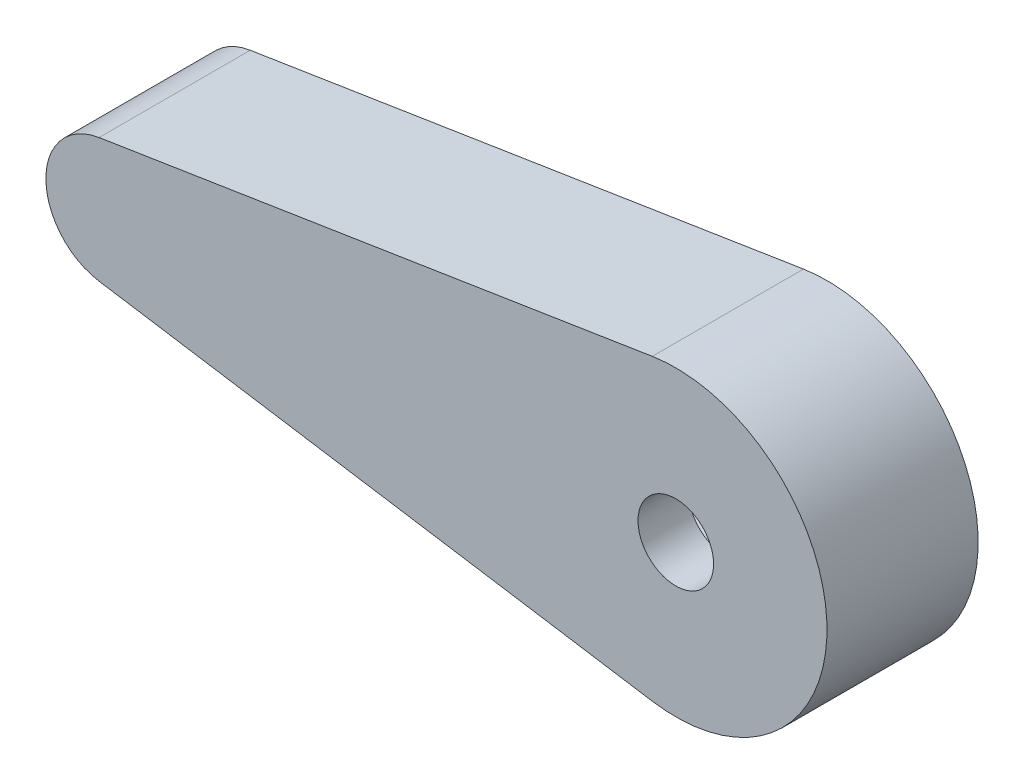
ISO-10303-21;
HEADER;
FILE_DESCRIPTION(('STEP AP214'),'2;1');
FILE_NAME('part.step','',(''),(''),'','','');
FILE_SCHEMA(('AUTOMOTIVE_DESIGN { 1 0 10303 214 1 1 1 1 }'));
ENDSEC;
DATA;
#1=APPLICATION_CONTEXT('core data for automotive mechanical design processes');
#2=APPLICATION_PROTOCOL_DEFINITION('international standard','automotive_design',2000,#1);
#3=PRODUCT_CONTEXT('',#1,'mechanical');
#4=PRODUCT('Part','Part','',(#3));
#5=PRODUCT_RELATED_PRODUCT_CATEGORY('part','',(#4));
#6=PRODUCT_DEFINITION_FORMATION('','',#4);
#7=PRODUCT_DEFINITION_CONTEXT('part definition',#1,'design');
#8=PRODUCT_DEFINITION('design','',#6,#7);
#9=PRODUCT_DEFINITION_SHAPE('','',#8);
#10=(LENGTH_UNIT() NAMED_UNIT(*) SI_UNIT(.MILLI.,.METRE.));
#11=(NAMED_UNIT(*) PLANE_ANGLE_UNIT() SI_UNIT($,.RADIAN.));
#12=(NAMED_UNIT(*) SI_UNIT($,.STERADIAN.) SOLID_ANGLE_UNIT());
#13=UNCERTAINTY_MEASURE_WITH_UNIT(LENGTH_MEASURE(1.E-05),#10,'distance_accuracy_value','');
#14=(GEOMETRIC_REPRESENTATION_CONTEXT(3) GLOBAL_UNCERTAINTY_ASSIGNED_CONTEXT((#13)) GLOBAL_UNIT_ASSIGNED_CONTEXT((#10,
#11,#12)) REPRESENTATION_CONTEXT('',''));
#15=CARTESIAN_POINT('',(0.,0.,0.));
#16=DIRECTION('',(0.,0.,1.));
#17=DIRECTION('',(1.,0.,0.));
#18=AXIS2_PLACEMENT_3D('',#15,#16,#17);
#19=CARTESIAN_POINT('',(-22.5000000000005,-5.73011883711468E-13,2.));
#20=DIRECTION('',(0.,0.,-1.));
#21=DIRECTION('',(-1.,0.,0.));
#22=AXIS2_PLACEMENT_3D('',#19,#20,#21);
#23=CYLINDRICAL_SURFACE('',#22,2.5);
#24=DIRECTION('',(0.,0.,-1.));
#25=VECTOR('',#24,1.);
#26=CARTESIAN_POINT('',(-22.8888888888894,2.46956786343197,2.));
#27=LINE('',#26,#25);
#28=CARTESIAN_POINT('',(-22.8888888888894,2.46956786343197,2.));
#29=VERTEX_POINT('',#28);
#30=CARTESIAN_POINT('',(-22.8888888888894,2.46956786343197,-4.));
#31=VERTEX_POINT('',#30);
#32=EDGE_CURVE('E163',#29,#31,#27,.T.);
#33=ORIENTED_EDGE('',*,*,#32,.T.);
#34=CARTESIAN_POINT('',(-22.5000000000005,-5.73011883711468E-13,-4.));
#35=DIRECTION('',(0.,0.,-1.));
#36=DIRECTION('',(-1.,0.,0.));
#37=AXIS2_PLACEMENT_3D('',#34,#35,#36);
#38=CIRCLE('',#37,2.5);
#39=CARTESIAN_POINT('',(-22.8888888888894,-2.46956786343311,-4.));
#40=VERTEX_POINT('',#39);
#41=EDGE_CURVE('E119',#40,#31,#38,.T.);
#42=ORIENTED_EDGE('',*,*,#41,.F.);
#43=DIRECTION('',(0.,0.,-1.));
#44=VECTOR('',#43,1.);
#45=CARTESIAN_POINT('',(-22.8888888888894,-2.46956786343311,2.));
#46=LINE('',#45,#44);
#47=CARTESIAN_POINT('',(-22.8888888888894,-2.46956786343311,2.));
#48=VERTEX_POINT('',#47);
#49=EDGE_CURVE('E11',#48,#40,#46,.T.);
#50=ORIENTED_EDGE('',*,*,#49,.F.);
#51=CARTESIAN_POINT('',(-22.5000000000005,-5.73011883711468E-13,2.));
#52=DIRECTION('',(0.,0.,1.));
#53=DIRECTION('',(1.,0.,0.));
#54=AXIS2_PLACEMENT_3D('',#51,#52,#53);
#55=CIRCLE('',#54,2.5);
#56=EDGE_CURVE('E156',#29,#48,#55,.T.);
#57=ORIENTED_EDGE('',*,*,#56,.F.);
#58=EDGE_LOOP('',(#33,#42,#50,#57));
#59=FACE_BOUND('',#58,.T.);
#60=ADVANCED_FACE('F38',(#59),#23,.T.);
#61=CARTESIAN_POINT('',(-22.8888888888894,-2.46956786343311,2.));
#62=DIRECTION('',(0.155555555555555,0.987827145373017,0.));
#63=DIRECTION('',(-0.987827145373017,0.155555555555555,0.));
#64=AXIS2_PLACEMENT_3D('',#61,#62,#63);
#65=PLANE('',#64);
#66=ORIENTED_EDGE('',*,*,#49,.T.);
#67=DIRECTION('',(-0.987827145373016,0.155555555555556,0.));
#68=VECTOR('',#67,1.);
#69=CARTESIAN_POINT('',(-0.933333333333847,-5.92696287223868,-4.));
#70=LINE('',#69,#68);
#71=CARTESIAN_POINT('',(-0.933333333333847,-5.92696287223868,-4.));
#72=VERTEX_POINT('',#71);
#73=EDGE_CURVE('E153',#72,#40,#70,.T.);
#74=ORIENTED_EDGE('',*,*,#73,.F.);
#75=DIRECTION('',(0.,0.,-1.));
#76=VECTOR('',#75,1.);
#77=CARTESIAN_POINT('',(-0.93333333333385,-5.92696287223867,2.));
#78=LINE('',#77,#76);
#79=CARTESIAN_POINT('',(-0.93333333333385,-5.92696287223867,2.));
#80=VERTEX_POINT('',#79);
#81=EDGE_CURVE('E45',#80,#72,#78,.T.);
#82=ORIENTED_EDGE('',*,*,#81,.F.);
#83=DIRECTION('',(0.987827145373016,-0.155555555555555,0.));
#84=VECTOR('',#83,1.);
#85=CARTESIAN_POINT('',(-22.8888888888894,-2.46956786343311,2.));
#86=LINE('',#85,#84);
#87=EDGE_CURVE('E158',#48,#80,#86,.T.);
#88=ORIENTED_EDGE('',*,*,#87,.F.);
#89=EDGE_LOOP('',(#66,#74,#82,#88));
#90=FACE_BOUND('',#89,.T.);
#91=ADVANCED_FACE('F177',(#90),#65,.F.);
#92=CARTESIAN_POINT('',(-5.369729792842E-13,-5.82182997684678E-13,2.));
#93=DIRECTION('',(0.,0.,-1.));
#94=DIRECTION('',(-1.,0.,0.));
#95=AXIS2_PLACEMENT_3D('',#92,#93,#94);
#96=CYLINDRICAL_SURFACE('',#95,6.);
#97=ORIENTED_EDGE('',*,*,#81,.T.);
#98=CARTESIAN_POINT('',(-5.369729792842E-13,-5.82182997684678E-13,-4.));
#99=DIRECTION('',(0.,0.,-1.));
#100=DIRECTION('',(-1.,0.,0.));
#101=AXIS2_PLACEMENT_3D('',#98,#99,#100);
#102=CIRCLE('',#101,6.);
#103=CARTESIAN_POINT('',(-0.933333333333848,5.92696287223752,-4.));
#104=VERTEX_POINT('',#103);
#105=EDGE_CURVE('E150',#104,#72,#102,.T.);
#106=ORIENTED_EDGE('',*,*,#105,.F.);
#107=DIRECTION('',(0.,0.,-1.));
#108=VECTOR('',#107,1.);
#109=CARTESIAN_POINT('',(-0.933333333333849,5.92696287223752,2.));
#110=LINE('',#109,#108);
#111=CARTESIAN_POINT('',(-0.933333333333849,5.92696287223752,2.));
#112=VERTEX_POINT('',#111);
#113=EDGE_CURVE('E165',#112,#104,#110,.T.);
#114=ORIENTED_EDGE('',*,*,#113,.F.);
#115=CARTESIAN_POINT('',(-5.369729792842E-13,-5.82182997684678E-13,2.));
#116=DIRECTION('',(0.,0.,1.));
#117=DIRECTION('',(1.,0.,0.));
#118=AXIS2_PLACEMENT_3D('',#115,#116,#117);
#119=CIRCLE('',#118,6.);
#120=EDGE_CURVE('E160',#80,#112,#119,.T.);
#121=ORIENTED_EDGE('',*,*,#120,.F.);
#122=EDGE_LOOP('',(#97,#106,#114,#121));
#123=FACE_BOUND('',#122,.T.);
#124=ADVANCED_FACE('F170',(#123),#96,.T.);
#125=CARTESIAN_POINT('',(-22.8888888888894,2.46956786343197,2.));
#126=DIRECTION('',(0.155555555555556,-0.987827145373016,0.));
#127=DIRECTION('',(0.987827145373017,0.155555555555556,0.));
#128=AXIS2_PLACEMENT_3D('',#125,#126,#127);
#129=PLANE('',#128);
#130=ORIENTED_EDGE('',*,*,#113,.T.);
#131=DIRECTION('',(0.987827145373016,0.155555555555555,0.));
#132=VECTOR('',#131,1.);
#133=CARTESIAN_POINT('',(-22.8888888888894,2.46956786343197,-4.));
#134=LINE('',#133,#132);
#135=EDGE_CURVE('E147',#31,#104,#134,.T.);
#136=ORIENTED_EDGE('',*,*,#135,.F.);
#137=ORIENTED_EDGE('',*,*,#32,.F.);
#138=DIRECTION('',(-0.987827145373016,-0.155555555555556,0.));
#139=VECTOR('',#138,1.);
#140=CARTESIAN_POINT('',(-22.8888888888894,2.46956786343197,2.));
#141=LINE('',#140,#139);
#142=EDGE_CURVE('E60',#112,#29,#141,.T.);
#143=ORIENTED_EDGE('',*,*,#142,.F.);
#144=EDGE_LOOP('',(#130,#136,#137,#143));
#145=FACE_BOUND('',#144,.T.);
#146=ADVANCED_FACE('F182',(#145),#129,.F.);
#147=CARTESIAN_POINT('',(-22.5000000000005,-5.73011883711468E-13,2.));
#148=DIRECTION('',(0.,0.,1.));
#149=DIRECTION('',(1.,0.,0.));
#150=AXIS2_PLACEMENT_3D('',#147,#148,#149);
#151=PLANE('',#150);
#152=CARTESIAN_POINT('',(0.,0.,2.));
#153=DIRECTION('',(0.,0.,-1.));
#154=DIRECTION('',(-1.,0.,0.));
#155=AXIS2_PLACEMENT_3D('',#152,#153,#154);
#156=CIRCLE('',#155,1.5);
#157=CARTESIAN_POINT('',(-1.5,0.,2.));
#158=VERTEX_POINT('',#157);
#159=EDGE_CURVE('E134',#158,#158,#156,.T.);
#160=ORIENTED_EDGE('',*,*,#159,.T.);
#161=EDGE_LOOP('',(#160));
#162=FACE_BOUND('',#161,.T.);
#163=ORIENTED_EDGE('',*,*,#56,.T.);
#164=ORIENTED_EDGE('',*,*,#87,.T.);
#165=ORIENTED_EDGE('',*,*,#120,.T.);
#166=ORIENTED_EDGE('',*,*,#142,.T.);
#167=EDGE_LOOP('',(#163,#164,#165,#166));
#168=FACE_BOUND('',#167,.T.);
#169=ADVANCED_FACE('F184',(#162,#168),#151,.T.);
#170=CARTESIAN_POINT('',(-22.5000000000005,-5.73011883711468E-13,-4.));
#171=DIRECTION('',(0.,0.,-1.));
#172=DIRECTION('',(-1.,0.,0.));
#173=AXIS2_PLACEMENT_3D('',#170,#171,#172);
#174=PLANE('',#173);
#175=ORIENTED_EDGE('',*,*,#41,.T.);
#176=ORIENTED_EDGE('',*,*,#135,.T.);
#177=ORIENTED_EDGE('',*,*,#105,.T.);
#178=ORIENTED_EDGE('',*,*,#73,.T.);
#179=EDGE_LOOP('',(#175,#176,#177,#178));
#180=FACE_BOUND('',#179,.T.);
#181=DIRECTION('',(-0.998510440144325,0.0545609835210726,0.));
#182=VECTOR('',#181,1.);
#183=CARTESIAN_POINT('',(-14.1754902620985,-2.29657401233195,-4.));
#184=LINE('',#183,#182);
#185=CARTESIAN_POINT('',(-2.32247414384049,-2.94425098305026,-4.));
#186=VERTEX_POINT('',#185);
#187=CARTESIAN_POINT('',(-14.1754902620985,-2.29657401233195,-4.));
#188=VERTEX_POINT('',#187);
#189=EDGE_CURVE('E111',#186,#188,#184,.T.);
#190=ORIENTED_EDGE('',*,*,#189,.F.);
#191=CARTESIAN_POINT('',(0.,0.,-4.));
#192=DIRECTION('',(0.,0.,-1.));
#193=DIRECTION('',(-1.,0.,0.));
#194=AXIS2_PLACEMENT_3D('',#191,#192,#193);
#195=CIRCLE('',#194,3.75);
#196=CARTESIAN_POINT('',(-2.32247414384049,2.94425098305026,-4.));
#197=VERTEX_POINT('',#196);
#198=EDGE_CURVE('E103',#197,#186,#195,.T.);
#199=ORIENTED_EDGE('',*,*,#198,.F.);
#200=DIRECTION('',(0.998510440144325,0.0545609835210729,0.));
#201=VECTOR('',#200,1.);
#202=CARTESIAN_POINT('',(-14.1754902620985,2.29657401233194,-4.));
#203=LINE('',#202,#201);
#204=CARTESIAN_POINT('',(-14.1754902620985,2.29657401233194,-4.));
#205=VERTEX_POINT('',#204);
#206=EDGE_CURVE('E127',#205,#197,#203,.T.);
#207=ORIENTED_EDGE('',*,*,#206,.F.);
#208=CARTESIAN_POINT('',(-14.05,0.,-4.));
#209=DIRECTION('',(0.,0.,-1.));
#210=DIRECTION('',(-1.,0.,0.));
#211=AXIS2_PLACEMENT_3D('',#208,#209,#210);
#212=CIRCLE('',#211,2.3);
#213=EDGE_CURVE('E125',#188,#205,#212,.T.);
#214=ORIENTED_EDGE('',*,*,#213,.F.);
#215=EDGE_LOOP('',(#190,#199,#207,#214));
#216=FACE_BOUND('',#215,.T.);
#217=ADVANCED_FACE('F123',(#180,#216),#174,.T.);
#218=CARTESIAN_POINT('',(0.,0.,-4.));
#219=DIRECTION('',(0.,0.,1.));
#220=DIRECTION('',(1.,0.,0.));
#221=AXIS2_PLACEMENT_3D('',#218,#219,#220);
#222=CYLINDRICAL_SURFACE('',#221,3.75);
#223=CARTESIAN_POINT('',(0.,0.,0.));
#224=DIRECTION('',(0.,0.,-1.));
#225=DIRECTION('',(-1.,0.,0.));
#226=AXIS2_PLACEMENT_3D('',#223,#224,#225);
#227=CIRCLE('',#226,3.75);
#228=CARTESIAN_POINT('',(-2.32247414384049,2.94425098305026,0.));
#229=VERTEX_POINT('',#228);
#230=CARTESIAN_POINT('',(-2.32247414384049,-2.94425098305026,0.));
#231=VERTEX_POINT('',#230);
#232=EDGE_CURVE('E132',#229,#231,#227,.T.);
#233=ORIENTED_EDGE('',*,*,#232,.F.);
#234=DIRECTION('',(0.,0.,1.));
#235=VECTOR('',#234,1.);
#236=CARTESIAN_POINT('',(-2.32247414384049,2.94425098305026,-4.));
#237=LINE('',#236,#235);
#238=EDGE_CURVE('E52',#197,#229,#237,.T.);
#239=ORIENTED_EDGE('',*,*,#238,.F.);
#240=ORIENTED_EDGE('',*,*,#198,.T.);
#241=DIRECTION('',(0.,0.,1.));
#242=VECTOR('',#241,1.);
#243=CARTESIAN_POINT('',(-2.32247414384049,-2.94425098305026,-4.));
#244=LINE('',#243,#242);
#245=EDGE_CURVE('E106',#186,#231,#244,.T.);
#246=ORIENTED_EDGE('',*,*,#245,.T.);
#247=EDGE_LOOP('',(#233,#239,#240,#246));
#248=FACE_BOUND('',#247,.T.);
#249=ADVANCED_FACE('F105',(#248),#222,.F.);
#250=CARTESIAN_POINT('',(-14.1754902620985,-2.29657401233195,-4.));
#251=DIRECTION('',(0.0545609835210726,0.998510440144325,0.));
#252=DIRECTION('',(-0.998510440144325,0.0545609835210726,0.));
#253=AXIS2_PLACEMENT_3D('',#250,#251,#252);
#254=PLANE('',#253);
#255=DIRECTION('',(-0.998510440144325,0.0545609835210726,0.));
#256=VECTOR('',#255,1.);
#257=CARTESIAN_POINT('',(-14.1754902620985,-2.29657401233195,0.));
#258=LINE('',#257,#256);
#259=CARTESIAN_POINT('',(-14.1754902620985,-2.29657401233195,0.));
#260=VERTEX_POINT('',#259);
#261=EDGE_CURVE('E118',#231,#260,#258,.T.);
#262=ORIENTED_EDGE('',*,*,#261,.F.);
#263=ORIENTED_EDGE('',*,*,#245,.F.);
#264=ORIENTED_EDGE('',*,*,#189,.T.);
#265=DIRECTION('',(0.,0.,1.));
#266=VECTOR('',#265,1.);
#267=CARTESIAN_POINT('',(-14.1754902620985,-2.29657401233195,-4.));
#268=LINE('',#267,#266);
#269=EDGE_CURVE('E120',#188,#260,#268,.T.);
#270=ORIENTED_EDGE('',*,*,#269,.T.);
#271=EDGE_LOOP('',(#262,#263,#264,#270));
#272=FACE_BOUND('',#271,.T.);
#273=ADVANCED_FACE('F115',(#272),#254,.T.);
#274=CARTESIAN_POINT('',(-14.05,0.,-4.));
#275=DIRECTION('',(0.,0.,1.));
#276=DIRECTION('',(1.,0.,0.));
#277=AXIS2_PLACEMENT_3D('',#274,#275,#276);
#278=CYLINDRICAL_SURFACE('',#277,2.3);
#279=CARTESIAN_POINT('',(-14.05,0.,0.));
#280=DIRECTION('',(0.,0.,-1.));
#281=DIRECTION('',(-1.,0.,0.));
#282=AXIS2_PLACEMENT_3D('',#279,#280,#281);
#283=CIRCLE('',#282,2.3);
#284=CARTESIAN_POINT('',(-14.1754902620985,2.29657401233194,0.));
#285=VERTEX_POINT('',#284);
#286=EDGE_CURVE('E136',#260,#285,#283,.T.);
#287=ORIENTED_EDGE('',*,*,#286,.F.);
#288=ORIENTED_EDGE('',*,*,#269,.F.);
#289=ORIENTED_EDGE('',*,*,#213,.T.);
#290=DIRECTION('',(0.,0.,1.));
#291=VECTOR('',#290,1.);
#292=CARTESIAN_POINT('',(-14.1754902620985,2.29657401233194,-4.));
#293=LINE('',#292,#291);
#294=EDGE_CURVE('E142',#205,#285,#293,.T.);
#295=ORIENTED_EDGE('',*,*,#294,.T.);
#296=EDGE_LOOP('',(#287,#288,#289,#295));
#297=FACE_BOUND('',#296,.T.);
#298=ADVANCED_FACE('F235',(#297),#278,.F.);
#299=CARTESIAN_POINT('',(-14.1754902620985,2.29657401233194,-4.));
#300=DIRECTION('',(0.0545609835210729,-0.998510440144325,0.));
#301=DIRECTION('',(0.998510440144325,0.0545609835210729,0.));
#302=AXIS2_PLACEMENT_3D('',#299,#300,#301);
#303=PLANE('',#302);
#304=DIRECTION('',(0.998510440144325,0.0545609835210729,0.));
#305=VECTOR('',#304,1.);
#306=CARTESIAN_POINT('',(-14.1754902620985,2.29657401233194,0.));
#307=LINE('',#306,#305);
#308=EDGE_CURVE('E112',#285,#229,#307,.T.);
#309=ORIENTED_EDGE('',*,*,#308,.F.);
#310=ORIENTED_EDGE('',*,*,#294,.F.);
#311=ORIENTED_EDGE('',*,*,#206,.T.);
#312=ORIENTED_EDGE('',*,*,#238,.T.);
#313=EDGE_LOOP('',(#309,#310,#311,#312));
#314=FACE_BOUND('',#313,.T.);
#315=ADVANCED_FACE('F244',(#314),#303,.T.);
#316=CARTESIAN_POINT('',(-22.5000000000005,-5.73011883711468E-13,0.));
#317=DIRECTION('',(0.,0.,1.));
#318=DIRECTION('',(1.,0.,0.));
#319=AXIS2_PLACEMENT_3D('',#316,#317,#318);
#320=PLANE('',#319);
#321=CARTESIAN_POINT('',(0.,0.,0.));
#322=DIRECTION('',(0.,0.,-1.));
#323=DIRECTION('',(-1.,0.,0.));
#324=AXIS2_PLACEMENT_3D('',#321,#322,#323);
#325=CIRCLE('',#324,1.5);
#326=CARTESIAN_POINT('',(-1.5,0.,0.));
#327=VERTEX_POINT('',#326);
#328=EDGE_CURVE('E288',#327,#327,#325,.T.);
#329=ORIENTED_EDGE('',*,*,#328,.F.);
#330=EDGE_LOOP('',(#329));
#331=FACE_BOUND('',#330,.T.);
#332=ORIENTED_EDGE('',*,*,#308,.T.);
#333=ORIENTED_EDGE('',*,*,#232,.T.);
#334=ORIENTED_EDGE('',*,*,#261,.T.);
#335=ORIENTED_EDGE('',*,*,#286,.T.);
#336=EDGE_LOOP('',(#332,#333,#334,#335));
#337=FACE_BOUND('',#336,.T.);
#338=ADVANCED_FACE('F254',(#331,#337),#320,.F.);
#339=CARTESIAN_POINT('',(0.,0.,2.));
#340=DIRECTION('',(0.,0.,-1.));
#341=DIRECTION('',(-1.,0.,0.));
#342=AXIS2_PLACEMENT_3D('',#339,#340,#341);
#343=CYLINDRICAL_SURFACE('',#342,1.5);
#344=ORIENTED_EDGE('',*,*,#159,.F.);
#345=EDGE_LOOP('',(#344));
#346=FACE_BOUND('',#345,.T.);
#347=ORIENTED_EDGE('',*,*,#328,.T.);
#348=EDGE_LOOP('',(#347));
#349=FACE_BOUND('',#348,.T.);
#350=ADVANCED_FACE('F270',(#346,#349),#343,.F.);
#351=CLOSED_SHELL('',(#60,#91,#124,#146,#169,#217,#249,#273,#298,#315,#338,#350));
#352=MANIFOLD_SOLID_BREP('B2',#351);
#353=ADVANCED_BREP_SHAPE_REPRESENTATION('',(#18,#352),#14);
#354=SHAPE_DEFINITION_REPRESENTATION(#9,#353);
ENDSEC;
END-ISO-10303-21;
